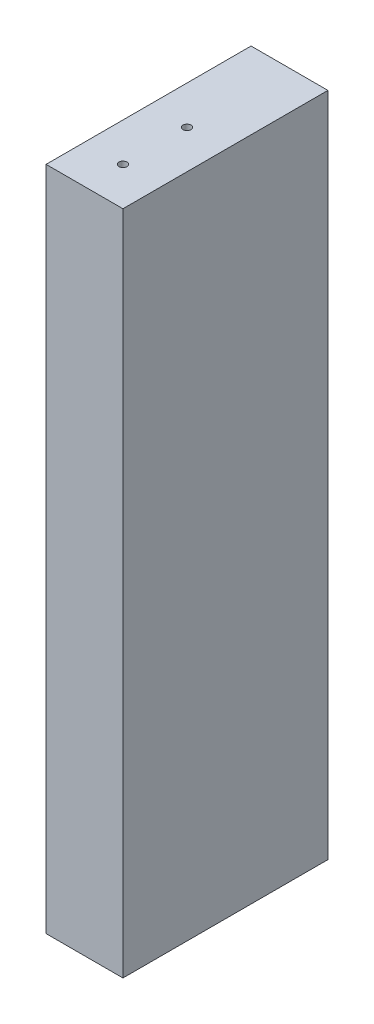
ISO-10303-21;
HEADER;
FILE_DESCRIPTION(('STEP AP214'),'2;1');
FILE_NAME('part.step','',(''),(''),'','','');
FILE_SCHEMA(('AUTOMOTIVE_DESIGN { 1 0 10303 214 1 1 1 1 }'));
ENDSEC;
DATA;
#1=APPLICATION_CONTEXT('core data for automotive mechanical design processes');
#2=APPLICATION_PROTOCOL_DEFINITION('international standard','automotive_design',2000,#1);
#3=PRODUCT_CONTEXT('',#1,'mechanical');
#4=PRODUCT('Part','Part','',(#3));
#5=PRODUCT_RELATED_PRODUCT_CATEGORY('part','',(#4));
#6=PRODUCT_DEFINITION_FORMATION('','',#4);
#7=PRODUCT_DEFINITION_CONTEXT('part definition',#1,'design');
#8=PRODUCT_DEFINITION('design','',#6,#7);
#9=PRODUCT_DEFINITION_SHAPE('','',#8);
#10=(LENGTH_UNIT() NAMED_UNIT(*) SI_UNIT(.MILLI.,.METRE.));
#11=(NAMED_UNIT(*) PLANE_ANGLE_UNIT() SI_UNIT($,.RADIAN.));
#12=(NAMED_UNIT(*) SI_UNIT($,.STERADIAN.) SOLID_ANGLE_UNIT());
#13=UNCERTAINTY_MEASURE_WITH_UNIT(LENGTH_MEASURE(1.E-05),#10,'distance_accuracy_value','');
#14=(GEOMETRIC_REPRESENTATION_CONTEXT(3) GLOBAL_UNCERTAINTY_ASSIGNED_CONTEXT((#13)) GLOBAL_UNIT_ASSIGNED_CONTEXT((#10,
#11,#12)) REPRESENTATION_CONTEXT('',''));
#15=CARTESIAN_POINT('',(0.,0.,0.));
#16=DIRECTION('',(0.,0.,1.));
#17=DIRECTION('',(1.,0.,0.));
#18=AXIS2_PLACEMENT_3D('',#15,#16,#17);
#19=CARTESIAN_POINT('',(450.092640905671,6101.08000027112,50.8));
#20=DIRECTION('',(-1.,0.,0.));
#21=DIRECTION('',(0.,0.,1.));
#22=AXIS2_PLACEMENT_3D('',#19,#20,#21);
#23=PLANE('',#22);
#24=DIRECTION('',(0.,1.,0.));
#25=VECTOR('',#24,1.);
#26=CARTESIAN_POINT('',(450.092640905671,6101.08000027112,0.));
#27=LINE('',#26,#25);
#28=CARTESIAN_POINT('',(450.092640905671,6101.08000027112,0.));
#29=VERTEX_POINT('',#28);
#30=CARTESIAN_POINT('',(450.092640905671,6266.18,0.));
#31=VERTEX_POINT('',#30);
#32=EDGE_CURVE('E147',#29,#31,#27,.T.);
#33=ORIENTED_EDGE('',*,*,#32,.T.);
#34=DIRECTION('',(0.,0.,-1.));
#35=VECTOR('',#34,1.);
#36=CARTESIAN_POINT('',(450.092640905671,6266.18,50.8));
#37=LINE('',#36,#35);
#38=CARTESIAN_POINT('',(450.092640905671,6266.18,50.8));
#39=VERTEX_POINT('',#38);
#40=EDGE_CURVE('E11',#39,#31,#37,.T.);
#41=ORIENTED_EDGE('',*,*,#40,.F.);
#42=DIRECTION('',(0.,1.,0.));
#43=VECTOR('',#42,1.);
#44=CARTESIAN_POINT('',(450.092640905671,6101.08000027112,50.8));
#45=LINE('',#44,#43);
#46=CARTESIAN_POINT('',(450.092640905671,6101.08000027112,50.8));
#47=VERTEX_POINT('',#46);
#48=EDGE_CURVE('E140',#47,#39,#45,.T.);
#49=ORIENTED_EDGE('',*,*,#48,.F.);
#50=DIRECTION('',(0.,0.,-1.));
#51=VECTOR('',#50,1.);
#52=CARTESIAN_POINT('',(450.092640905671,6101.08000027112,50.8));
#53=LINE('',#52,#51);
#54=EDGE_CURVE('E146',#47,#29,#53,.T.);
#55=ORIENTED_EDGE('',*,*,#54,.T.);
#56=EDGE_LOOP('',(#33,#41,#49,#55));
#57=FACE_BOUND('',#56,.T.);
#58=ADVANCED_FACE('F32',(#57),#23,.F.);
#59=CARTESIAN_POINT('',(450.092640905671,6266.18,50.8));
#60=DIRECTION('',(0.,-1.,0.));
#61=DIRECTION('',(0.,0.,-1.));
#62=AXIS2_PLACEMENT_3D('',#59,#60,#61);
#63=PLANE('',#62);
#64=CARTESIAN_POINT('',(440.567640905671,6266.18,25.3999560447612));
#65=DIRECTION('',(0.,1.,0.));
#66=DIRECTION('',(0.,0.,1.));
#67=AXIS2_PLACEMENT_3D('',#64,#65,#66);
#68=CIRCLE('',#67,0.992251);
#69=CARTESIAN_POINT('',(440.567640905671,6266.18,26.3922070447612));
#70=VERTEX_POINT('',#69);
#71=EDGE_CURVE('E111',#70,#70,#68,.T.);
#72=ORIENTED_EDGE('',*,*,#71,.F.);
#73=EDGE_LOOP('',(#72));
#74=FACE_BOUND('',#73,.T.);
#75=CARTESIAN_POINT('',(440.567640905671,6266.18,41.2749560447612));
#76=DIRECTION('',(0.,1.,0.));
#77=DIRECTION('',(0.,0.,1.));
#78=AXIS2_PLACEMENT_3D('',#75,#76,#77);
#79=CIRCLE('',#78,0.992251);
#80=CARTESIAN_POINT('',(440.567640905671,6266.18,42.2672070447612));
#81=VERTEX_POINT('',#80);
#82=EDGE_CURVE('E110',#81,#81,#79,.T.);
#83=ORIENTED_EDGE('',*,*,#82,.F.);
#84=EDGE_LOOP('',(#83));
#85=FACE_BOUND('',#84,.T.);
#86=DIRECTION('',(-1.,0.,0.));
#87=VECTOR('',#86,1.);
#88=CARTESIAN_POINT('',(450.092640905671,6266.18,0.));
#89=LINE('',#88,#87);
#90=CARTESIAN_POINT('',(431.042640905671,6266.18,0.));
#91=VERTEX_POINT('',#90);
#92=EDGE_CURVE('E150',#31,#91,#89,.T.);
#93=ORIENTED_EDGE('',*,*,#92,.T.);
#94=DIRECTION('',(0.,0.,-1.));
#95=VECTOR('',#94,1.);
#96=CARTESIAN_POINT('',(431.042640905671,6266.18,50.8));
#97=LINE('',#96,#95);
#98=CARTESIAN_POINT('',(431.042640905671,6266.18,50.8));
#99=VERTEX_POINT('',#98);
#100=EDGE_CURVE('E41',#99,#91,#97,.T.);
#101=ORIENTED_EDGE('',*,*,#100,.F.);
#102=DIRECTION('',(-1.,0.,0.));
#103=VECTOR('',#102,1.);
#104=CARTESIAN_POINT('',(450.092640905671,6266.18,50.8));
#105=LINE('',#104,#103);
#106=EDGE_CURVE('E81',#39,#99,#105,.T.);
#107=ORIENTED_EDGE('',*,*,#106,.F.);
#108=ORIENTED_EDGE('',*,*,#40,.T.);
#109=EDGE_LOOP('',(#93,#101,#107,#108));
#110=FACE_BOUND('',#109,.T.);
#111=ADVANCED_FACE('F181',(#74,#85,#110),#63,.F.);
#112=CARTESIAN_POINT('',(431.042640905671,6101.08000027112,50.8));
#113=DIRECTION('',(1.,0.,0.));
#114=DIRECTION('',(0.,0.,-1.));
#115=AXIS2_PLACEMENT_3D('',#112,#113,#114);
#116=PLANE('',#115);
#117=DIRECTION('',(0.,-1.,0.));
#118=VECTOR('',#117,1.);
#119=CARTESIAN_POINT('',(431.042640905671,6101.08000027112,0.));
#120=LINE('',#119,#118);
#121=CARTESIAN_POINT('',(431.042640905671,6101.08000027112,0.));
#122=VERTEX_POINT('',#121);
#123=EDGE_CURVE('E68',#91,#122,#120,.T.);
#124=ORIENTED_EDGE('',*,*,#123,.T.);
#125=DIRECTION('',(0.,0.,-1.));
#126=VECTOR('',#125,1.);
#127=CARTESIAN_POINT('',(431.042640905671,6101.08000027112,50.8));
#128=LINE('',#127,#126);
#129=CARTESIAN_POINT('',(431.042640905671,6101.08000027112,50.8));
#130=VERTEX_POINT('',#129);
#131=EDGE_CURVE('E155',#130,#122,#128,.T.);
#132=ORIENTED_EDGE('',*,*,#131,.F.);
#133=DIRECTION('',(0.,-1.,0.));
#134=VECTOR('',#133,1.);
#135=CARTESIAN_POINT('',(431.042640905671,6101.08000027112,50.8));
#136=LINE('',#135,#134);
#137=EDGE_CURVE('E143',#99,#130,#136,.T.);
#138=ORIENTED_EDGE('',*,*,#137,.F.);
#139=ORIENTED_EDGE('',*,*,#100,.T.);
#140=EDGE_LOOP('',(#124,#132,#138,#139));
#141=FACE_BOUND('',#140,.T.);
#142=ADVANCED_FACE('F186',(#141),#116,.F.);
#143=CARTESIAN_POINT('',(450.092640905671,6101.08000027112,50.8));
#144=DIRECTION('',(0.,1.,0.));
#145=DIRECTION('',(0.,0.,1.));
#146=AXIS2_PLACEMENT_3D('',#143,#144,#145);
#147=PLANE('',#146);
#148=CARTESIAN_POINT('',(440.567640905671,6101.08000027112,41.2749560447612));
#149=DIRECTION('',(0.,-1.,0.));
#150=DIRECTION('',(0.,0.,-1.));
#151=AXIS2_PLACEMENT_3D('',#148,#149,#150);
#152=CIRCLE('',#151,0.992251);
#153=CARTESIAN_POINT('',(440.567640905671,6101.08000027112,40.2827050447612));
#154=VERTEX_POINT('',#153);
#155=EDGE_CURVE('E121',#154,#154,#152,.T.);
#156=ORIENTED_EDGE('',*,*,#155,.F.);
#157=EDGE_LOOP('',(#156));
#158=FACE_BOUND('',#157,.T.);
#159=CARTESIAN_POINT('',(440.567640905671,6101.08000027112,25.3999560447612));
#160=DIRECTION('',(0.,-1.,0.));
#161=DIRECTION('',(0.,0.,-1.));
#162=AXIS2_PLACEMENT_3D('',#159,#160,#161);
#163=CIRCLE('',#162,0.992251);
#164=CARTESIAN_POINT('',(440.567640905671,6101.08000027112,24.4077050447612));
#165=VERTEX_POINT('',#164);
#166=EDGE_CURVE('E127',#165,#165,#163,.T.);
#167=ORIENTED_EDGE('',*,*,#166,.F.);
#168=EDGE_LOOP('',(#167));
#169=FACE_BOUND('',#168,.T.);
#170=DIRECTION('',(1.,0.,0.));
#171=VECTOR('',#170,1.);
#172=CARTESIAN_POINT('',(450.092640905671,6101.08000027112,0.));
#173=LINE('',#172,#171);
#174=EDGE_CURVE('E74',#122,#29,#173,.T.);
#175=ORIENTED_EDGE('',*,*,#174,.T.);
#176=ORIENTED_EDGE('',*,*,#54,.F.);
#177=DIRECTION('',(1.,0.,0.));
#178=VECTOR('',#177,1.);
#179=CARTESIAN_POINT('',(450.092640905671,6101.08000027112,50.8));
#180=LINE('',#179,#178);
#181=EDGE_CURVE('E50',#130,#47,#180,.T.);
#182=ORIENTED_EDGE('',*,*,#181,.F.);
#183=ORIENTED_EDGE('',*,*,#131,.T.);
#184=EDGE_LOOP('',(#175,#176,#182,#183));
#185=FACE_BOUND('',#184,.T.);
#186=ADVANCED_FACE('F193',(#158,#169,#185),#147,.F.);
#187=CARTESIAN_POINT('',(0.,0.,50.8));
#188=DIRECTION('',(0.,0.,1.));
#189=DIRECTION('',(1.,0.,0.));
#190=AXIS2_PLACEMENT_3D('',#187,#188,#189);
#191=PLANE('',#190);
#192=ORIENTED_EDGE('',*,*,#48,.T.);
#193=ORIENTED_EDGE('',*,*,#106,.T.);
#194=ORIENTED_EDGE('',*,*,#137,.T.);
#195=ORIENTED_EDGE('',*,*,#181,.T.);
#196=EDGE_LOOP('',(#192,#193,#194,#195));
#197=FACE_BOUND('',#196,.T.);
#198=ADVANCED_FACE('F175',(#197),#191,.T.);
#199=CARTESIAN_POINT('',(0.,0.,0.));
#200=DIRECTION('',(0.,0.,1.));
#201=DIRECTION('',(1.,0.,0.));
#202=AXIS2_PLACEMENT_3D('',#199,#200,#201);
#203=PLANE('',#202);
#204=CARTESIAN_POINT('',(440.567640905671,6221.73000013556,0.));
#205=DIRECTION('',(0.,0.,1.));
#206=DIRECTION('',(1.,0.,0.));
#207=AXIS2_PLACEMENT_3D('',#204,#205,#206);
#208=CIRCLE('',#207,0.992251);
#209=CARTESIAN_POINT('',(441.559891905671,6221.73000013556,0.));
#210=VERTEX_POINT('',#209);
#211=EDGE_CURVE('E35',#210,#210,#208,.T.);
#212=ORIENTED_EDGE('',*,*,#211,.T.);
#213=EDGE_LOOP('',(#212));
#214=FACE_BOUND('',#213,.T.);
#215=CARTESIAN_POINT('',(440.567640905671,6145.53000013556,0.));
#216=DIRECTION('',(0.,0.,1.));
#217=DIRECTION('',(1.,0.,0.));
#218=AXIS2_PLACEMENT_3D('',#215,#216,#217);
#219=CIRCLE('',#218,0.992251);
#220=CARTESIAN_POINT('',(441.559891905671,6145.53000013556,0.));
#221=VERTEX_POINT('',#220);
#222=EDGE_CURVE('E139',#221,#221,#219,.T.);
#223=ORIENTED_EDGE('',*,*,#222,.T.);
#224=EDGE_LOOP('',(#223));
#225=FACE_BOUND('',#224,.T.);
#226=ORIENTED_EDGE('',*,*,#32,.F.);
#227=ORIENTED_EDGE('',*,*,#174,.F.);
#228=ORIENTED_EDGE('',*,*,#123,.F.);
#229=ORIENTED_EDGE('',*,*,#92,.F.);
#230=EDGE_LOOP('',(#226,#227,#228,#229));
#231=FACE_BOUND('',#230,.T.);
#232=ADVANCED_FACE('F160',(#214,#225,#231),#203,.F.);
#233=CARTESIAN_POINT('',(440.567640905671,6145.53000013818,-19.0501068246319));
#234=DIRECTION('',(0.,1.37705190708017E-10,-1.));
#235=DIRECTION('',(0.,1.,1.37705190708017E-10));
#236=AXIS2_PLACEMENT_3D('',#233,#234,#235);
#237=CYLINDRICAL_SURFACE('',#236,0.992251);
#238=CARTESIAN_POINT('',(440.567640905671,6145.53000013294,19.0498931753681));
#239=DIRECTION('',(0.,1.37705190708017E-10,-1.));
#240=DIRECTION('',(0.,1.,1.37705190708017E-10));
#241=AXIS2_PLACEMENT_3D('',#238,#239,#240);
#242=CIRCLE('',#241,0.992251);
#243=CARTESIAN_POINT('',(440.567640905671,6146.52225113294,19.0498931755047));
#244=VERTEX_POINT('',#243);
#245=EDGE_CURVE('E136',#244,#244,#242,.T.);
#246=ORIENTED_EDGE('',*,*,#245,.F.);
#247=EDGE_LOOP('',(#246));
#248=FACE_BOUND('',#247,.T.);
#249=ORIENTED_EDGE('',*,*,#222,.F.);
#250=EDGE_LOOP('',(#249));
#251=FACE_BOUND('',#250,.T.);
#252=ADVANCED_FACE('F163',(#248,#251),#237,.F.);
#253=CARTESIAN_POINT('',(440.567640905671,6145.53000013294,19.0498931753681));
#254=DIRECTION('',(0.,1.37705190708017E-10,-1.));
#255=DIRECTION('',(0.,1.,1.37705190708017E-10));
#256=AXIS2_PLACEMENT_3D('',#253,#254,#255);
#257=CONICAL_SURFACE('',#256,0.992251,1.02974425867666);
#258=CARTESIAN_POINT('',(440.567640905671,6145.53000013285,19.6460977254588));
#259=VERTEX_POINT('',#258);
#260=VERTEX_LOOP('',#259);
#261=FACE_BOUND('',#260,.T.);
#262=ORIENTED_EDGE('',*,*,#245,.T.);
#263=EDGE_LOOP('',(#262));
#264=FACE_BOUND('',#263,.T.);
#265=ADVANCED_FACE('F165',(#261,#264),#257,.F.);
#266=CARTESIAN_POINT('',(440.567640905671,6221.73000013818,-19.0501068141388));
#267=DIRECTION('',(0.,1.37705190708017E-10,-1.));
#268=DIRECTION('',(0.,1.,1.37705190708017E-10));
#269=AXIS2_PLACEMENT_3D('',#266,#267,#268);
#270=CYLINDRICAL_SURFACE('',#269,0.992251);
#271=CARTESIAN_POINT('',(440.567640905671,6221.73000013294,19.0498931858612));
#272=DIRECTION('',(0.,1.37705190708017E-10,-1.));
#273=DIRECTION('',(0.,1.,1.37705190708017E-10));
#274=AXIS2_PLACEMENT_3D('',#271,#272,#273);
#275=CIRCLE('',#274,0.992251);
#276=CARTESIAN_POINT('',(440.567640905671,6222.72225113294,19.0498931859978));
#277=VERTEX_POINT('',#276);
#278=EDGE_CURVE('E133',#277,#277,#275,.T.);
#279=ORIENTED_EDGE('',*,*,#278,.F.);
#280=EDGE_LOOP('',(#279));
#281=FACE_BOUND('',#280,.T.);
#282=ORIENTED_EDGE('',*,*,#211,.F.);
#283=EDGE_LOOP('',(#282));
#284=FACE_BOUND('',#283,.T.);
#285=ADVANCED_FACE('F172',(#281,#284),#270,.F.);
#286=CARTESIAN_POINT('',(440.567640905671,6221.73000013294,19.0498931858612));
#287=DIRECTION('',(0.,1.37705190708017E-10,-1.));
#288=DIRECTION('',(0.,1.,1.37705190708017E-10));
#289=AXIS2_PLACEMENT_3D('',#286,#287,#288);
#290=CONICAL_SURFACE('',#289,0.992251,1.02974425867666);
#291=CARTESIAN_POINT('',(440.567640905671,6221.73000013285,19.6460977359519));
#292=VERTEX_POINT('',#291);
#293=VERTEX_LOOP('',#292);
#294=FACE_BOUND('',#293,.T.);
#295=ORIENTED_EDGE('',*,*,#278,.T.);
#296=EDGE_LOOP('',(#295));
#297=FACE_BOUND('',#296,.T.);
#298=ADVANCED_FACE('F217',(#294,#297),#290,.F.);
#299=CARTESIAN_POINT('',(440.567640905671,6120.13000027112,25.3999560447612));
#300=DIRECTION('',(0.,-1.,0.));
#301=DIRECTION('',(0.,0.,-1.));
#302=AXIS2_PLACEMENT_3D('',#299,#300,#301);
#303=CONICAL_SURFACE('',#302,0.992251,1.02974425867684);
#304=CARTESIAN_POINT('',(440.567640905671,6120.72620482121,25.3999560447612));
#305=VERTEX_POINT('',#304);
#306=VERTEX_LOOP('',#305);
#307=FACE_BOUND('',#306,.T.);
#308=CARTESIAN_POINT('',(440.567640905671,6120.13000027112,25.3999560447612));
#309=DIRECTION('',(0.,-1.,0.));
#310=DIRECTION('',(0.,0.,-1.));
#311=AXIS2_PLACEMENT_3D('',#308,#309,#310);
#312=CIRCLE('',#311,0.992251);
#313=CARTESIAN_POINT('',(440.567640905671,6120.13000027112,24.4077050447612));
#314=VERTEX_POINT('',#313);
#315=EDGE_CURVE('E130',#314,#314,#312,.T.);
#316=ORIENTED_EDGE('',*,*,#315,.T.);
#317=EDGE_LOOP('',(#316));
#318=FACE_BOUND('',#317,.T.);
#319=ADVANCED_FACE('F222',(#307,#318),#303,.F.);
#320=CARTESIAN_POINT('',(440.567640905671,6101.08000027112,25.3999560447612));
#321=DIRECTION('',(0.,-1.,0.));
#322=DIRECTION('',(0.,0.,-1.));
#323=AXIS2_PLACEMENT_3D('',#320,#321,#322);
#324=CYLINDRICAL_SURFACE('',#323,0.992251);
#325=ORIENTED_EDGE('',*,*,#315,.F.);
#326=EDGE_LOOP('',(#325));
#327=FACE_BOUND('',#326,.T.);
#328=ORIENTED_EDGE('',*,*,#166,.T.);
#329=EDGE_LOOP('',(#328));
#330=FACE_BOUND('',#329,.T.);
#331=ADVANCED_FACE('F227',(#327,#330),#324,.F.);
#332=CARTESIAN_POINT('',(440.567640905671,6120.13000027112,41.2749560447612));
#333=DIRECTION('',(0.,-1.,0.));
#334=DIRECTION('',(0.,0.,-1.));
#335=AXIS2_PLACEMENT_3D('',#332,#333,#334);
#336=CONICAL_SURFACE('',#335,0.992251,1.02974425867684);
#337=CARTESIAN_POINT('',(440.567640905671,6120.72620482121,41.2749560447612));
#338=VERTEX_POINT('',#337);
#339=VERTEX_LOOP('',#338);
#340=FACE_BOUND('',#339,.T.);
#341=CARTESIAN_POINT('',(440.567640905671,6120.13000027112,41.2749560447612));
#342=DIRECTION('',(0.,-1.,0.));
#343=DIRECTION('',(0.,0.,-1.));
#344=AXIS2_PLACEMENT_3D('',#341,#342,#343);
#345=CIRCLE('',#344,0.992251);
#346=CARTESIAN_POINT('',(440.567640905671,6120.13000027112,40.2827050447612));
#347=VERTEX_POINT('',#346);
#348=EDGE_CURVE('E124',#347,#347,#345,.T.);
#349=ORIENTED_EDGE('',*,*,#348,.T.);
#350=EDGE_LOOP('',(#349));
#351=FACE_BOUND('',#350,.T.);
#352=ADVANCED_FACE('F237',(#340,#351),#336,.F.);
#353=CARTESIAN_POINT('',(440.567640905671,6101.08000027112,41.2749560447612));
#354=DIRECTION('',(0.,-1.,0.));
#355=DIRECTION('',(0.,0.,-1.));
#356=AXIS2_PLACEMENT_3D('',#353,#354,#355);
#357=CYLINDRICAL_SURFACE('',#356,0.992251);
#358=ORIENTED_EDGE('',*,*,#348,.F.);
#359=EDGE_LOOP('',(#358));
#360=FACE_BOUND('',#359,.T.);
#361=ORIENTED_EDGE('',*,*,#155,.T.);
#362=EDGE_LOOP('',(#361));
#363=FACE_BOUND('',#362,.T.);
#364=ADVANCED_FACE('F247',(#360,#363),#357,.F.);
#365=CARTESIAN_POINT('',(440.567640905671,6247.13,41.2749560447612));
#366=DIRECTION('',(0.,1.,0.));
#367=DIRECTION('',(0.,0.,1.));
#368=AXIS2_PLACEMENT_3D('',#365,#366,#367);
#369=CONICAL_SURFACE('',#368,0.992251,1.02974425867684);
#370=CARTESIAN_POINT('',(440.567640905671,6246.53379544991,41.2749560447612));
#371=VERTEX_POINT('',#370);
#372=VERTEX_LOOP('',#371);
#373=FACE_BOUND('',#372,.T.);
#374=CARTESIAN_POINT('',(440.567640905671,6247.13,41.2749560447612));
#375=DIRECTION('',(0.,1.,0.));
#376=DIRECTION('',(0.,0.,1.));
#377=AXIS2_PLACEMENT_3D('',#374,#375,#376);
#378=CIRCLE('',#377,0.992251);
#379=CARTESIAN_POINT('',(440.567640905671,6247.13,42.2672070447612));
#380=VERTEX_POINT('',#379);
#381=EDGE_CURVE('E114',#380,#380,#378,.T.);
#382=ORIENTED_EDGE('',*,*,#381,.T.);
#383=EDGE_LOOP('',(#382));
#384=FACE_BOUND('',#383,.T.);
#385=ADVANCED_FACE('F256',(#373,#384),#369,.F.);
#386=CARTESIAN_POINT('',(440.567640905671,6266.18,41.2749560447612));
#387=DIRECTION('',(0.,1.,0.));
#388=DIRECTION('',(0.,0.,1.));
#389=AXIS2_PLACEMENT_3D('',#386,#387,#388);
#390=CYLINDRICAL_SURFACE('',#389,0.992251);
#391=ORIENTED_EDGE('',*,*,#381,.F.);
#392=EDGE_LOOP('',(#391));
#393=FACE_BOUND('',#392,.T.);
#394=ORIENTED_EDGE('',*,*,#82,.T.);
#395=EDGE_LOOP('',(#394));
#396=FACE_BOUND('',#395,.T.);
#397=ADVANCED_FACE('F104',(#393,#396),#390,.F.);
#398=CARTESIAN_POINT('',(440.567640905671,6247.13,25.3999560447612));
#399=DIRECTION('',(0.,1.,0.));
#400=DIRECTION('',(0.,0.,1.));
#401=AXIS2_PLACEMENT_3D('',#398,#399,#400);
#402=CONICAL_SURFACE('',#401,0.992251,1.02974425867684);
#403=CARTESIAN_POINT('',(440.567640905671,6246.53379544991,25.3999560447612));
#404=VERTEX_POINT('',#403);
#405=VERTEX_LOOP('',#404);
#406=FACE_BOUND('',#405,.T.);
#407=CARTESIAN_POINT('',(440.567640905671,6247.13,25.3999560447612));
#408=DIRECTION('',(0.,1.,0.));
#409=DIRECTION('',(0.,0.,1.));
#410=AXIS2_PLACEMENT_3D('',#407,#408,#409);
#411=CIRCLE('',#410,0.992251);
#412=CARTESIAN_POINT('',(440.567640905671,6247.13,26.3922070447612));
#413=VERTEX_POINT('',#412);
#414=EDGE_CURVE('E108',#413,#413,#411,.T.);
#415=ORIENTED_EDGE('',*,*,#414,.T.);
#416=EDGE_LOOP('',(#415));
#417=FACE_BOUND('',#416,.T.);
#418=ADVANCED_FACE('F100',(#406,#417),#402,.F.);
#419=CARTESIAN_POINT('',(440.567640905671,6266.18,25.3999560447612));
#420=DIRECTION('',(0.,1.,0.));
#421=DIRECTION('',(0.,0.,1.));
#422=AXIS2_PLACEMENT_3D('',#419,#420,#421);
#423=CYLINDRICAL_SURFACE('',#422,0.992251);
#424=ORIENTED_EDGE('',*,*,#414,.F.);
#425=EDGE_LOOP('',(#424));
#426=FACE_BOUND('',#425,.T.);
#427=ORIENTED_EDGE('',*,*,#71,.T.);
#428=EDGE_LOOP('',(#427));
#429=FACE_BOUND('',#428,.T.);
#430=ADVANCED_FACE('F103',(#426,#429),#423,.F.);
#431=CLOSED_SHELL('',(#58,#111,#142,#186,#198,#232,#252,#265,#285,#298,#319,#331,#352,#364,#385,
#397,#418,#430));
#432=MANIFOLD_SOLID_BREP('B2',#431);
#433=ADVANCED_BREP_SHAPE_REPRESENTATION('',(#18,#432),#14);
#434=SHAPE_DEFINITION_REPRESENTATION(#9,#433);
ENDSEC;
END-ISO-10303-21;
